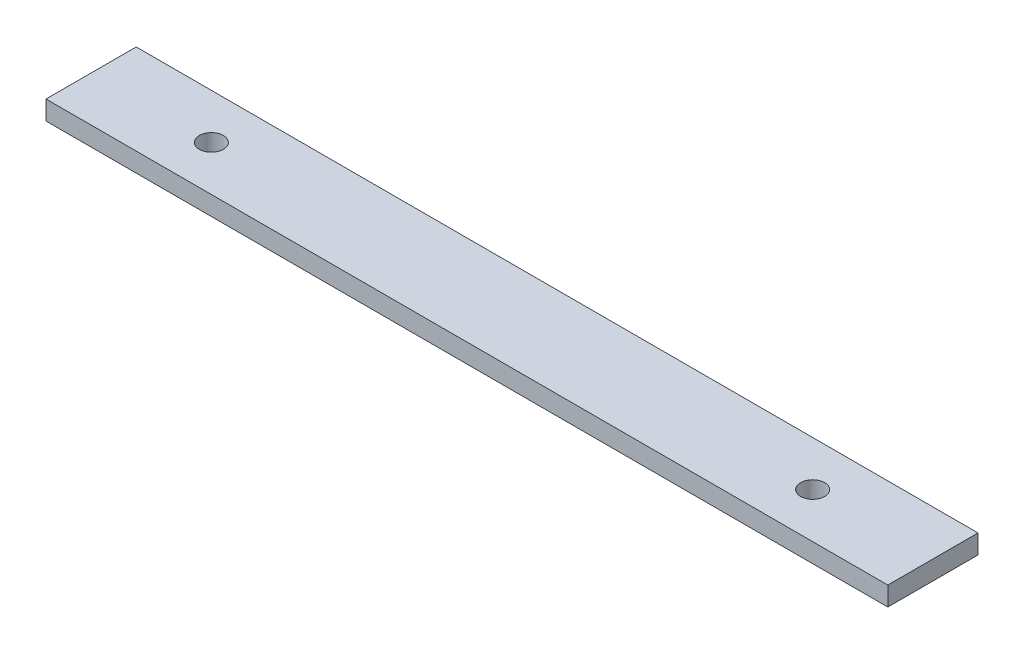
ISO-10303-21;
HEADER;
FILE_DESCRIPTION(('STEP AP214'),'2;1');
FILE_NAME('part.step','',(''),(''),'','','');
FILE_SCHEMA(('AUTOMOTIVE_DESIGN { 1 0 10303 214 1 1 1 1 }'));
ENDSEC;
DATA;
#1=APPLICATION_CONTEXT('core data for automotive mechanical design processes');
#2=APPLICATION_PROTOCOL_DEFINITION('international standard','automotive_design',2000,#1);
#3=PRODUCT_CONTEXT('',#1,'mechanical');
#4=PRODUCT('Part','Part','',(#3));
#5=PRODUCT_RELATED_PRODUCT_CATEGORY('part','',(#4));
#6=PRODUCT_DEFINITION_FORMATION('','',#4);
#7=PRODUCT_DEFINITION_CONTEXT('part definition',#1,'design');
#8=PRODUCT_DEFINITION('design','',#6,#7);
#9=PRODUCT_DEFINITION_SHAPE('','',#8);
#10=(LENGTH_UNIT() NAMED_UNIT(*) SI_UNIT(.MILLI.,.METRE.));
#11=(NAMED_UNIT(*) PLANE_ANGLE_UNIT() SI_UNIT($,.RADIAN.));
#12=(NAMED_UNIT(*) SI_UNIT($,.STERADIAN.) SOLID_ANGLE_UNIT());
#13=UNCERTAINTY_MEASURE_WITH_UNIT(LENGTH_MEASURE(1.E-05),#10,'distance_accuracy_value','');
#14=(GEOMETRIC_REPRESENTATION_CONTEXT(3) GLOBAL_UNCERTAINTY_ASSIGNED_CONTEXT((#13)) GLOBAL_UNIT_ASSIGNED_CONTEXT((#10,
#11,#12)) REPRESENTATION_CONTEXT('',''));
#15=CARTESIAN_POINT('',(0.,0.,0.));
#16=DIRECTION('',(0.,0.,1.));
#17=DIRECTION('',(1.,0.,0.));
#18=AXIS2_PLACEMENT_3D('',#15,#16,#17);
#19=CARTESIAN_POINT('',(0.,3.175,0.));
#20=DIRECTION('',(0.,-1.,0.));
#21=DIRECTION('',(0.,0.,-1.));
#22=AXIS2_PLACEMENT_3D('',#19,#20,#21);
#23=PLANE('',#22);
#24=DIRECTION('',(0.,0.,1.));
#25=VECTOR('',#24,1.);
#26=CARTESIAN_POINT('',(-70.,3.175,-7.49999999999999));
#27=LINE('',#26,#25);
#28=CARTESIAN_POINT('',(-70.,3.175,-7.49999999999999));
#29=VERTEX_POINT('',#28);
#30=CARTESIAN_POINT('',(-70.,3.175,7.50000000000001));
#31=VERTEX_POINT('',#30);
#32=EDGE_CURVE('E91',#29,#31,#27,.T.);
#33=ORIENTED_EDGE('',*,*,#32,.T.);
#34=DIRECTION('',(1.,0.,0.));
#35=VECTOR('',#34,1.);
#36=CARTESIAN_POINT('',(70.,3.175,7.49999999999999));
#37=LINE('',#36,#35);
#38=CARTESIAN_POINT('',(70.,3.175,7.49999999999999));
#39=VERTEX_POINT('',#38);
#40=EDGE_CURVE('E86',#31,#39,#37,.T.);
#41=ORIENTED_EDGE('',*,*,#40,.T.);
#42=DIRECTION('',(0.,0.,-1.));
#43=VECTOR('',#42,1.);
#44=CARTESIAN_POINT('',(70.,3.175,-7.50000000000001));
#45=LINE('',#44,#43);
#46=CARTESIAN_POINT('',(70.,3.175,-7.50000000000001));
#47=VERTEX_POINT('',#46);
#48=EDGE_CURVE('E89',#39,#47,#45,.T.);
#49=ORIENTED_EDGE('',*,*,#48,.T.);
#50=DIRECTION('',(-1.,0.,0.));
#51=VECTOR('',#50,1.);
#52=CARTESIAN_POINT('',(70.,3.175,-7.50000000000001));
#53=LINE('',#52,#51);
#54=EDGE_CURVE('E56',#47,#29,#53,.T.);
#55=ORIENTED_EDGE('',*,*,#54,.T.);
#56=EDGE_LOOP('',(#33,#41,#49,#55));
#57=FACE_BOUND('',#56,.T.);
#58=CARTESIAN_POINT('',(-50.,3.175,0.));
#59=DIRECTION('',(0.,1.,0.));
#60=DIRECTION('',(0.,0.,1.));
#61=AXIS2_PLACEMENT_3D('',#58,#59,#60);
#62=CIRCLE('',#61,2.);
#63=CARTESIAN_POINT('',(-50.,3.175,2.));
#64=VERTEX_POINT('',#63);
#65=EDGE_CURVE('E106',#64,#64,#62,.T.);
#66=ORIENTED_EDGE('',*,*,#65,.F.);
#67=EDGE_LOOP('',(#66));
#68=FACE_BOUND('',#67,.T.);
#69=CARTESIAN_POINT('',(50.,3.175,0.));
#70=DIRECTION('',(0.,1.,0.));
#71=DIRECTION('',(0.,0.,1.));
#72=AXIS2_PLACEMENT_3D('',#69,#70,#71);
#73=CIRCLE('',#72,2.);
#74=CARTESIAN_POINT('',(50.,3.175,1.99999999999997));
#75=VERTEX_POINT('',#74);
#76=EDGE_CURVE('E121',#75,#75,#73,.T.);
#77=ORIENTED_EDGE('',*,*,#76,.F.);
#78=EDGE_LOOP('',(#77));
#79=FACE_BOUND('',#78,.T.);
#80=ADVANCED_FACE('F39',(#57,#68,#79),#23,.F.);
#81=CARTESIAN_POINT('',(0.,0.,0.));
#82=DIRECTION('',(0.,-1.,0.));
#83=DIRECTION('',(0.,0.,-1.));
#84=AXIS2_PLACEMENT_3D('',#81,#82,#83);
#85=PLANE('',#84);
#86=CARTESIAN_POINT('',(-50.,0.,0.));
#87=DIRECTION('',(0.,1.,0.));
#88=DIRECTION('',(0.,0.,1.));
#89=AXIS2_PLACEMENT_3D('',#86,#87,#88);
#90=CIRCLE('',#89,2.);
#91=CARTESIAN_POINT('',(-50.,0.,2.));
#92=VERTEX_POINT('',#91);
#93=EDGE_CURVE('E118',#92,#92,#90,.T.);
#94=ORIENTED_EDGE('',*,*,#93,.T.);
#95=EDGE_LOOP('',(#94));
#96=FACE_BOUND('',#95,.T.);
#97=DIRECTION('',(0.,0.,1.));
#98=VECTOR('',#97,1.);
#99=CARTESIAN_POINT('',(-70.,0.,-7.49999999999999));
#100=LINE('',#99,#98);
#101=CARTESIAN_POINT('',(-70.,0.,-7.49999999999999));
#102=VERTEX_POINT('',#101);
#103=CARTESIAN_POINT('',(-70.,0.,7.50000000000001));
#104=VERTEX_POINT('',#103);
#105=EDGE_CURVE('E103',#102,#104,#100,.T.);
#106=ORIENTED_EDGE('',*,*,#105,.F.);
#107=DIRECTION('',(-1.,0.,0.));
#108=VECTOR('',#107,1.);
#109=CARTESIAN_POINT('',(70.,0.,-7.50000000000001));
#110=LINE('',#109,#108);
#111=CARTESIAN_POINT('',(70.,0.,-7.50000000000001));
#112=VERTEX_POINT('',#111);
#113=EDGE_CURVE('E79',#112,#102,#110,.T.);
#114=ORIENTED_EDGE('',*,*,#113,.F.);
#115=DIRECTION('',(0.,0.,-1.));
#116=VECTOR('',#115,1.);
#117=CARTESIAN_POINT('',(70.,0.,-7.50000000000001));
#118=LINE('',#117,#116);
#119=CARTESIAN_POINT('',(70.,0.,7.49999999999999));
#120=VERTEX_POINT('',#119);
#121=EDGE_CURVE('E73',#120,#112,#118,.T.);
#122=ORIENTED_EDGE('',*,*,#121,.F.);
#123=DIRECTION('',(1.,0.,0.));
#124=VECTOR('',#123,1.);
#125=CARTESIAN_POINT('',(70.,0.,7.49999999999999));
#126=LINE('',#125,#124);
#127=EDGE_CURVE('E95',#104,#120,#126,.T.);
#128=ORIENTED_EDGE('',*,*,#127,.F.);
#129=EDGE_LOOP('',(#106,#114,#122,#128));
#130=FACE_BOUND('',#129,.T.);
#131=CARTESIAN_POINT('',(50.,0.,0.));
#132=DIRECTION('',(0.,1.,0.));
#133=DIRECTION('',(0.,0.,1.));
#134=AXIS2_PLACEMENT_3D('',#131,#132,#133);
#135=CIRCLE('',#134,2.);
#136=CARTESIAN_POINT('',(50.,0.,1.99999999999997));
#137=VERTEX_POINT('',#136);
#138=EDGE_CURVE('E124',#137,#137,#135,.T.);
#139=ORIENTED_EDGE('',*,*,#138,.T.);
#140=EDGE_LOOP('',(#139));
#141=FACE_BOUND('',#140,.T.);
#142=ADVANCED_FACE('F114',(#96,#130,#141),#85,.T.);
#143=CARTESIAN_POINT('',(-70.,3.175,-7.49999999999999));
#144=DIRECTION('',(1.,0.,0.));
#145=DIRECTION('',(0.,0.,-1.));
#146=AXIS2_PLACEMENT_3D('',#143,#144,#145);
#147=PLANE('',#146);
#148=ORIENTED_EDGE('',*,*,#105,.T.);
#149=DIRECTION('',(0.,-1.,0.));
#150=VECTOR('',#149,1.);
#151=CARTESIAN_POINT('',(-70.,3.175,7.50000000000001));
#152=LINE('',#151,#150);
#153=EDGE_CURVE('E11',#31,#104,#152,.T.);
#154=ORIENTED_EDGE('',*,*,#153,.F.);
#155=ORIENTED_EDGE('',*,*,#32,.F.);
#156=DIRECTION('',(0.,-1.,0.));
#157=VECTOR('',#156,1.);
#158=CARTESIAN_POINT('',(-70.,3.175,-7.49999999999999));
#159=LINE('',#158,#157);
#160=EDGE_CURVE('E99',#29,#102,#159,.T.);
#161=ORIENTED_EDGE('',*,*,#160,.T.);
#162=EDGE_LOOP('',(#148,#154,#155,#161));
#163=FACE_BOUND('',#162,.T.);
#164=ADVANCED_FACE('F41',(#163),#147,.F.);
#165=CARTESIAN_POINT('',(70.,3.175,7.49999999999999));
#166=DIRECTION('',(0.,0.,-1.));
#167=DIRECTION('',(-1.,0.,0.));
#168=AXIS2_PLACEMENT_3D('',#165,#166,#167);
#169=PLANE('',#168);
#170=ORIENTED_EDGE('',*,*,#127,.T.);
#171=DIRECTION('',(0.,-1.,0.));
#172=VECTOR('',#171,1.);
#173=CARTESIAN_POINT('',(70.,3.175,7.49999999999999));
#174=LINE('',#173,#172);
#175=EDGE_CURVE('E48',#39,#120,#174,.T.);
#176=ORIENTED_EDGE('',*,*,#175,.F.);
#177=ORIENTED_EDGE('',*,*,#40,.F.);
#178=ORIENTED_EDGE('',*,*,#153,.T.);
#179=EDGE_LOOP('',(#170,#176,#177,#178));
#180=FACE_BOUND('',#179,.T.);
#181=ADVANCED_FACE('F94',(#180),#169,.F.);
#182=CARTESIAN_POINT('',(70.,3.175,-7.50000000000001));
#183=DIRECTION('',(-1.,0.,0.));
#184=DIRECTION('',(0.,0.,1.));
#185=AXIS2_PLACEMENT_3D('',#182,#183,#184);
#186=PLANE('',#185);
#187=ORIENTED_EDGE('',*,*,#121,.T.);
#188=DIRECTION('',(0.,-1.,0.));
#189=VECTOR('',#188,1.);
#190=CARTESIAN_POINT('',(70.,3.175,-7.50000000000001));
#191=LINE('',#190,#189);
#192=EDGE_CURVE('E96',#47,#112,#191,.T.);
#193=ORIENTED_EDGE('',*,*,#192,.F.);
#194=ORIENTED_EDGE('',*,*,#48,.F.);
#195=ORIENTED_EDGE('',*,*,#175,.T.);
#196=EDGE_LOOP('',(#187,#193,#194,#195));
#197=FACE_BOUND('',#196,.T.);
#198=ADVANCED_FACE('F97',(#197),#186,.F.);
#199=CARTESIAN_POINT('',(70.,3.175,-7.50000000000001));
#200=DIRECTION('',(0.,0.,1.));
#201=DIRECTION('',(1.,0.,0.));
#202=AXIS2_PLACEMENT_3D('',#199,#200,#201);
#203=PLANE('',#202);
#204=ORIENTED_EDGE('',*,*,#113,.T.);
#205=ORIENTED_EDGE('',*,*,#160,.F.);
#206=ORIENTED_EDGE('',*,*,#54,.F.);
#207=ORIENTED_EDGE('',*,*,#192,.T.);
#208=EDGE_LOOP('',(#204,#205,#206,#207));
#209=FACE_BOUND('',#208,.T.);
#210=ADVANCED_FACE('F111',(#209),#203,.F.);
#211=CARTESIAN_POINT('',(-50.,3.175,0.));
#212=DIRECTION('',(0.,-1.,0.));
#213=DIRECTION('',(0.,0.,-1.));
#214=AXIS2_PLACEMENT_3D('',#211,#212,#213);
#215=CYLINDRICAL_SURFACE('',#214,2.);
#216=ORIENTED_EDGE('',*,*,#65,.T.);
#217=EDGE_LOOP('',(#216));
#218=FACE_BOUND('',#217,.T.);
#219=ORIENTED_EDGE('',*,*,#93,.F.);
#220=EDGE_LOOP('',(#219));
#221=FACE_BOUND('',#220,.T.);
#222=ADVANCED_FACE('F141',(#218,#221),#215,.F.);
#223=CARTESIAN_POINT('',(50.,3.175,0.));
#224=DIRECTION('',(0.,-1.,0.));
#225=DIRECTION('',(0.,0.,-1.));
#226=AXIS2_PLACEMENT_3D('',#223,#224,#225);
#227=CYLINDRICAL_SURFACE('',#226,2.);
#228=ORIENTED_EDGE('',*,*,#76,.T.);
#229=EDGE_LOOP('',(#228));
#230=FACE_BOUND('',#229,.T.);
#231=ORIENTED_EDGE('',*,*,#138,.F.);
#232=EDGE_LOOP('',(#231));
#233=FACE_BOUND('',#232,.T.);
#234=ADVANCED_FACE('F130',(#230,#233),#227,.F.);
#235=CLOSED_SHELL('',(#80,#142,#164,#181,#198,#210,#222,#234));
#236=MANIFOLD_SOLID_BREP('B2',#235);
#237=ADVANCED_BREP_SHAPE_REPRESENTATION('',(#18,#236),#14);
#238=SHAPE_DEFINITION_REPRESENTATION(#9,#237);
ENDSEC;
END-ISO-10303-21;
